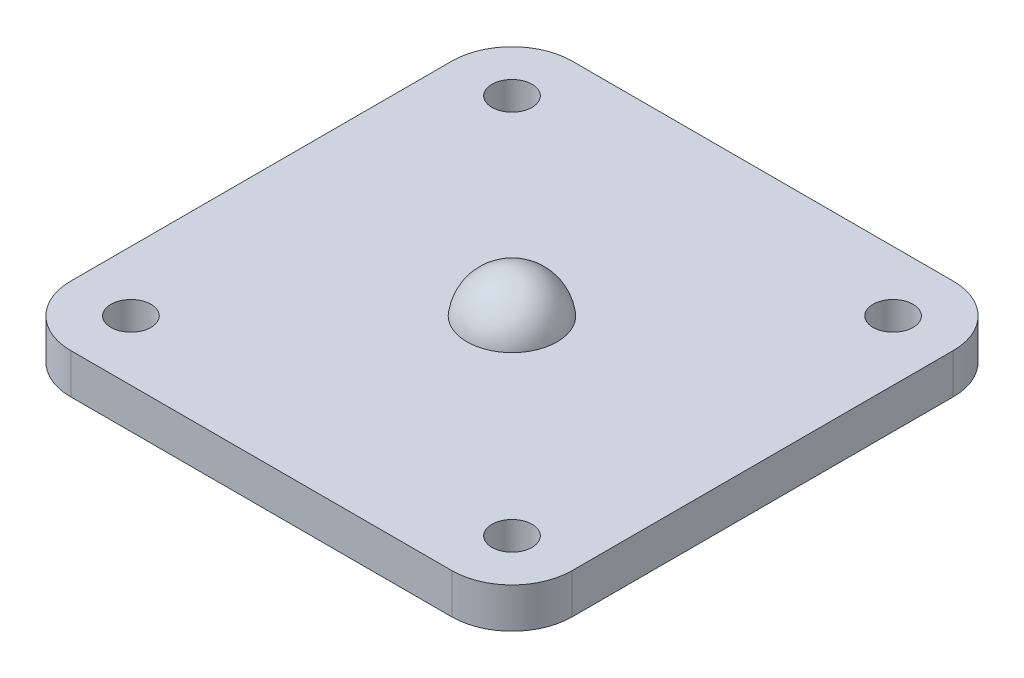
ISO-10303-21;
HEADER;
FILE_DESCRIPTION(('STEP AP214'),'2;1');
FILE_NAME('part.step','',(''),(''),'','','');
FILE_SCHEMA(('AUTOMOTIVE_DESIGN { 1 0 10303 214 1 1 1 1 }'));
ENDSEC;
DATA;
#1=APPLICATION_CONTEXT('core data for automotive mechanical design processes');
#2=APPLICATION_PROTOCOL_DEFINITION('international standard','automotive_design',2000,#1);
#3=PRODUCT_CONTEXT('',#1,'mechanical');
#4=PRODUCT('Part','Part','',(#3));
#5=PRODUCT_RELATED_PRODUCT_CATEGORY('part','',(#4));
#6=PRODUCT_DEFINITION_FORMATION('','',#4);
#7=PRODUCT_DEFINITION_CONTEXT('part definition',#1,'design');
#8=PRODUCT_DEFINITION('design','',#6,#7);
#9=PRODUCT_DEFINITION_SHAPE('','',#8);
#10=(LENGTH_UNIT() NAMED_UNIT(*) SI_UNIT(.MILLI.,.METRE.));
#11=(NAMED_UNIT(*) PLANE_ANGLE_UNIT() SI_UNIT($,.RADIAN.));
#12=(NAMED_UNIT(*) SI_UNIT($,.STERADIAN.) SOLID_ANGLE_UNIT());
#13=UNCERTAINTY_MEASURE_WITH_UNIT(LENGTH_MEASURE(1.E-05),#10,'distance_accuracy_value','');
#14=(GEOMETRIC_REPRESENTATION_CONTEXT(3) GLOBAL_UNCERTAINTY_ASSIGNED_CONTEXT((#13)) GLOBAL_UNIT_ASSIGNED_CONTEXT((#10,
#11,#12)) REPRESENTATION_CONTEXT('',''));
#15=CARTESIAN_POINT('',(0.,0.,0.));
#16=DIRECTION('',(0.,0.,1.));
#17=DIRECTION('',(1.,0.,0.));
#18=AXIS2_PLACEMENT_3D('',#15,#16,#17);
#19=CARTESIAN_POINT('',(12.5,2.,12.5));
#20=DIRECTION('',(-1.,0.,0.));
#21=DIRECTION('',(0.,0.,1.));
#22=AXIS2_PLACEMENT_3D('',#19,#20,#21);
#23=PLANE('',#22);
#24=DIRECTION('',(0.,0.,-1.));
#25=VECTOR('',#24,1.);
#26=CARTESIAN_POINT('',(12.5,0.,12.5));
#27=LINE('',#26,#25);
#28=CARTESIAN_POINT('',(12.5,0.,9.5));
#29=VERTEX_POINT('',#28);
#30=CARTESIAN_POINT('',(12.5,0.,-9.5));
#31=VERTEX_POINT('',#30);
#32=EDGE_CURVE('E142',#29,#31,#27,.T.);
#33=ORIENTED_EDGE('',*,*,#32,.T.);
#34=DIRECTION('',(0.,-1.,0.));
#35=VECTOR('',#34,1.);
#36=CARTESIAN_POINT('',(12.5,2.,-9.5));
#37=LINE('',#36,#35);
#38=CARTESIAN_POINT('',(12.5,2.,-9.5));
#39=VERTEX_POINT('',#38);
#40=EDGE_CURVE('E175',#31,#39,#37,.F.);
#41=ORIENTED_EDGE('',*,*,#40,.T.);
#42=DIRECTION('',(0.,0.,-1.));
#43=VECTOR('',#42,1.);
#44=CARTESIAN_POINT('',(12.5,2.,12.5));
#45=LINE('',#44,#43);
#46=CARTESIAN_POINT('',(12.5,2.,9.5));
#47=VERTEX_POINT('',#46);
#48=EDGE_CURVE('E140',#47,#39,#45,.T.);
#49=ORIENTED_EDGE('',*,*,#48,.F.);
#50=DIRECTION('',(0.,-1.,0.));
#51=VECTOR('',#50,1.);
#52=CARTESIAN_POINT('',(12.5,2.,9.5));
#53=LINE('',#52,#51);
#54=EDGE_CURVE('E171',#47,#29,#53,.T.);
#55=ORIENTED_EDGE('',*,*,#54,.T.);
#56=EDGE_LOOP('',(#33,#41,#49,#55));
#57=FACE_BOUND('',#56,.T.);
#58=ADVANCED_FACE('F39',(#57),#23,.F.);
#59=CARTESIAN_POINT('',(-12.5,2.,-12.5));
#60=DIRECTION('',(0.,0.,1.));
#61=DIRECTION('',(1.,0.,0.));
#62=AXIS2_PLACEMENT_3D('',#59,#60,#61);
#63=PLANE('',#62);
#64=DIRECTION('',(-1.,0.,0.));
#65=VECTOR('',#64,1.);
#66=CARTESIAN_POINT('',(-12.5,0.,-12.5));
#67=LINE('',#66,#65);
#68=CARTESIAN_POINT('',(9.5,0.,-12.5));
#69=VERTEX_POINT('',#68);
#70=CARTESIAN_POINT('',(-9.5,0.,-12.5));
#71=VERTEX_POINT('',#70);
#72=EDGE_CURVE('E136',#69,#71,#67,.T.);
#73=ORIENTED_EDGE('',*,*,#72,.T.);
#74=DIRECTION('',(0.,-1.,0.));
#75=VECTOR('',#74,1.);
#76=CARTESIAN_POINT('',(-9.5,2.,-12.5));
#77=LINE('',#76,#75);
#78=CARTESIAN_POINT('',(-9.5,2.,-12.5));
#79=VERTEX_POINT('',#78);
#80=EDGE_CURVE('E111',#71,#79,#77,.F.);
#81=ORIENTED_EDGE('',*,*,#80,.T.);
#82=DIRECTION('',(-1.,0.,0.));
#83=VECTOR('',#82,1.);
#84=CARTESIAN_POINT('',(-12.5,2.,-12.5));
#85=LINE('',#84,#83);
#86=CARTESIAN_POINT('',(9.5,2.,-12.5));
#87=VERTEX_POINT('',#86);
#88=EDGE_CURVE('E182',#87,#79,#85,.T.);
#89=ORIENTED_EDGE('',*,*,#88,.F.);
#90=DIRECTION('',(0.,-1.,0.));
#91=VECTOR('',#90,1.);
#92=CARTESIAN_POINT('',(9.5,2.,-12.5));
#93=LINE('',#92,#91);
#94=EDGE_CURVE('E117',#87,#69,#93,.T.);
#95=ORIENTED_EDGE('',*,*,#94,.T.);
#96=EDGE_LOOP('',(#73,#81,#89,#95));
#97=FACE_BOUND('',#96,.T.);
#98=ADVANCED_FACE('F251',(#97),#63,.F.);
#99=CARTESIAN_POINT('',(-12.5,2.,12.5));
#100=DIRECTION('',(1.,0.,0.));
#101=DIRECTION('',(0.,0.,-1.));
#102=AXIS2_PLACEMENT_3D('',#99,#100,#101);
#103=PLANE('',#102);
#104=DIRECTION('',(0.,0.,1.));
#105=VECTOR('',#104,1.);
#106=CARTESIAN_POINT('',(-12.5,2.,12.5));
#107=LINE('',#106,#105);
#108=CARTESIAN_POINT('',(-12.5,2.,-9.5));
#109=VERTEX_POINT('',#108);
#110=CARTESIAN_POINT('',(-12.5,2.,9.5));
#111=VERTEX_POINT('',#110);
#112=EDGE_CURVE('E126',#109,#111,#107,.T.);
#113=ORIENTED_EDGE('',*,*,#112,.F.);
#114=DIRECTION('',(0.,-1.,0.));
#115=VECTOR('',#114,1.);
#116=CARTESIAN_POINT('',(-12.5,2.,-9.5));
#117=LINE('',#116,#115);
#118=CARTESIAN_POINT('',(-12.5,0.,-9.5));
#119=VERTEX_POINT('',#118);
#120=EDGE_CURVE('E110',#109,#119,#117,.T.);
#121=ORIENTED_EDGE('',*,*,#120,.T.);
#122=DIRECTION('',(0.,0.,1.));
#123=VECTOR('',#122,1.);
#124=CARTESIAN_POINT('',(-12.5,0.,12.5));
#125=LINE('',#124,#123);
#126=CARTESIAN_POINT('',(-12.5,0.,9.5));
#127=VERTEX_POINT('',#126);
#128=EDGE_CURVE('E124',#119,#127,#125,.T.);
#129=ORIENTED_EDGE('',*,*,#128,.T.);
#130=DIRECTION('',(0.,-1.,0.));
#131=VECTOR('',#130,1.);
#132=CARTESIAN_POINT('',(-12.5,2.,9.5));
#133=LINE('',#132,#131);
#134=EDGE_CURVE('E129',#127,#111,#133,.F.);
#135=ORIENTED_EDGE('',*,*,#134,.T.);
#136=EDGE_LOOP('',(#113,#121,#129,#135));
#137=FACE_BOUND('',#136,.T.);
#138=ADVANCED_FACE('F123',(#137),#103,.F.);
#139=CARTESIAN_POINT('',(-12.5,2.,12.5));
#140=DIRECTION('',(0.,0.,-1.));
#141=DIRECTION('',(-1.,0.,0.));
#142=AXIS2_PLACEMENT_3D('',#139,#140,#141);
#143=PLANE('',#142);
#144=DIRECTION('',(1.,0.,0.));
#145=VECTOR('',#144,1.);
#146=CARTESIAN_POINT('',(-12.5,2.,12.5));
#147=LINE('',#146,#145);
#148=CARTESIAN_POINT('',(-9.5,2.,12.5));
#149=VERTEX_POINT('',#148);
#150=CARTESIAN_POINT('',(9.5,2.,12.5));
#151=VERTEX_POINT('',#150);
#152=EDGE_CURVE('E147',#149,#151,#147,.T.);
#153=ORIENTED_EDGE('',*,*,#152,.F.);
#154=DIRECTION('',(0.,-1.,0.));
#155=VECTOR('',#154,1.);
#156=CARTESIAN_POINT('',(-9.5,2.,12.5));
#157=LINE('',#156,#155);
#158=CARTESIAN_POINT('',(-9.5,0.,12.5));
#159=VERTEX_POINT('',#158);
#160=EDGE_CURVE('E11',#149,#159,#157,.T.);
#161=ORIENTED_EDGE('',*,*,#160,.T.);
#162=DIRECTION('',(1.,0.,0.));
#163=VECTOR('',#162,1.);
#164=CARTESIAN_POINT('',(-12.5,0.,12.5));
#165=LINE('',#164,#163);
#166=CARTESIAN_POINT('',(9.5,0.,12.5));
#167=VERTEX_POINT('',#166);
#168=EDGE_CURVE('E135',#159,#167,#165,.T.);
#169=ORIENTED_EDGE('',*,*,#168,.T.);
#170=DIRECTION('',(0.,-1.,0.));
#171=VECTOR('',#170,1.);
#172=CARTESIAN_POINT('',(9.5,2.,12.5));
#173=LINE('',#172,#171);
#174=EDGE_CURVE('E48',#167,#151,#173,.F.);
#175=ORIENTED_EDGE('',*,*,#174,.T.);
#176=EDGE_LOOP('',(#153,#161,#169,#175));
#177=FACE_BOUND('',#176,.T.);
#178=ADVANCED_FACE('F274',(#177),#143,.F.);
#179=CARTESIAN_POINT('',(0.,2.,0.));
#180=DIRECTION('',(0.,-1.,0.));
#181=DIRECTION('',(0.,0.,-1.));
#182=AXIS2_PLACEMENT_3D('',#179,#180,#181);
#183=PLANE('',#182);
#184=CARTESIAN_POINT('',(0.,2.,0.));
#185=DIRECTION('',(0.,-1.,0.));
#186=DIRECTION('',(0.,0.,-1.));
#187=AXIS2_PLACEMENT_3D('',#184,#185,#186);
#188=CIRCLE('',#187,2.25);
#189=CARTESIAN_POINT('',(0.,2.,-2.25));
#190=VERTEX_POINT('',#189);
#191=EDGE_CURVE('E213',#190,#190,#188,.T.);
#192=ORIENTED_EDGE('',*,*,#191,.T.);
#193=EDGE_LOOP('',(#192));
#194=FACE_BOUND('',#193,.T.);
#195=CARTESIAN_POINT('',(-9.5,2.,9.5));
#196=DIRECTION('',(0.,1.,0.));
#197=DIRECTION('',(0.,0.,1.));
#198=AXIS2_PLACEMENT_3D('',#195,#196,#197);
#199=CIRCLE('',#198,1.);
#200=CARTESIAN_POINT('',(-9.5,2.,10.5));
#201=VERTEX_POINT('',#200);
#202=EDGE_CURVE('E212',#201,#201,#199,.T.);
#203=ORIENTED_EDGE('',*,*,#202,.F.);
#204=EDGE_LOOP('',(#203));
#205=FACE_BOUND('',#204,.T.);
#206=CARTESIAN_POINT('',(9.5,2.,9.5));
#207=DIRECTION('',(0.,1.,0.));
#208=DIRECTION('',(0.,0.,1.));
#209=AXIS2_PLACEMENT_3D('',#206,#207,#208);
#210=CIRCLE('',#209,1.);
#211=CARTESIAN_POINT('',(9.5,2.,10.5));
#212=VERTEX_POINT('',#211);
#213=EDGE_CURVE('E221',#212,#212,#210,.T.);
#214=ORIENTED_EDGE('',*,*,#213,.F.);
#215=EDGE_LOOP('',(#214));
#216=FACE_BOUND('',#215,.T.);
#217=CARTESIAN_POINT('',(9.5,2.,-9.5));
#218=DIRECTION('',(0.,1.,0.));
#219=DIRECTION('',(0.,0.,1.));
#220=AXIS2_PLACEMENT_3D('',#217,#218,#219);
#221=CIRCLE('',#220,1.);
#222=CARTESIAN_POINT('',(9.5,2.,-8.5));
#223=VERTEX_POINT('',#222);
#224=EDGE_CURVE('E206',#223,#223,#221,.T.);
#225=ORIENTED_EDGE('',*,*,#224,.F.);
#226=EDGE_LOOP('',(#225));
#227=FACE_BOUND('',#226,.T.);
#228=CARTESIAN_POINT('',(-9.5,2.,-9.5));
#229=DIRECTION('',(0.,1.,0.));
#230=DIRECTION('',(0.,0.,1.));
#231=AXIS2_PLACEMENT_3D('',#228,#229,#230);
#232=CIRCLE('',#231,1.);
#233=CARTESIAN_POINT('',(-9.5,2.,-8.5));
#234=VERTEX_POINT('',#233);
#235=EDGE_CURVE('E196',#234,#234,#232,.T.);
#236=ORIENTED_EDGE('',*,*,#235,.F.);
#237=EDGE_LOOP('',(#236));
#238=FACE_BOUND('',#237,.T.);
#239=ORIENTED_EDGE('',*,*,#88,.T.);
#240=CARTESIAN_POINT('',(-9.5,2.,-9.5));
#241=DIRECTION('',(0.,-1.,0.));
#242=DIRECTION('',(0.,0.,-1.));
#243=AXIS2_PLACEMENT_3D('',#240,#241,#242);
#244=CIRCLE('',#243,3.);
#245=EDGE_CURVE('E168',#79,#109,#244,.F.);
#246=ORIENTED_EDGE('',*,*,#245,.T.);
#247=ORIENTED_EDGE('',*,*,#112,.T.);
#248=CARTESIAN_POINT('',(-9.5,2.,9.5));
#249=DIRECTION('',(0.,-1.,0.));
#250=DIRECTION('',(0.,0.,-1.));
#251=AXIS2_PLACEMENT_3D('',#248,#249,#250);
#252=CIRCLE('',#251,3.);
#253=EDGE_CURVE('E61',#111,#149,#252,.F.);
#254=ORIENTED_EDGE('',*,*,#253,.T.);
#255=ORIENTED_EDGE('',*,*,#152,.T.);
#256=CARTESIAN_POINT('',(9.5,2.,9.5));
#257=DIRECTION('',(0.,-1.,0.));
#258=DIRECTION('',(0.,0.,-1.));
#259=AXIS2_PLACEMENT_3D('',#256,#257,#258);
#260=CIRCLE('',#259,3.);
#261=EDGE_CURVE('E160',#151,#47,#260,.F.);
#262=ORIENTED_EDGE('',*,*,#261,.T.);
#263=ORIENTED_EDGE('',*,*,#48,.T.);
#264=CARTESIAN_POINT('',(9.5,2.,-9.5));
#265=DIRECTION('',(0.,-1.,0.));
#266=DIRECTION('',(0.,0.,-1.));
#267=AXIS2_PLACEMENT_3D('',#264,#265,#266);
#268=CIRCLE('',#267,3.);
#269=EDGE_CURVE('E165',#39,#87,#268,.F.);
#270=ORIENTED_EDGE('',*,*,#269,.T.);
#271=EDGE_LOOP('',(#239,#246,#247,#254,#255,#262,#263,#270));
#272=FACE_BOUND('',#271,.T.);
#273=ADVANCED_FACE('F236',(#194,#205,#216,#227,#238,#272),#183,.F.);
#274=CARTESIAN_POINT('',(0.,0.,0.));
#275=DIRECTION('',(0.,-1.,0.));
#276=DIRECTION('',(0.,0.,-1.));
#277=AXIS2_PLACEMENT_3D('',#274,#275,#276);
#278=PLANE('',#277);
#279=CARTESIAN_POINT('',(-9.5,0.,9.5));
#280=DIRECTION('',(0.,-1.,0.));
#281=DIRECTION('',(0.,0.,-1.));
#282=AXIS2_PLACEMENT_3D('',#279,#280,#281);
#283=CIRCLE('',#282,1.);
#284=CARTESIAN_POINT('',(-9.5,0.,8.5));
#285=VERTEX_POINT('',#284);
#286=EDGE_CURVE('E208',#285,#285,#283,.F.);
#287=ORIENTED_EDGE('',*,*,#286,.T.);
#288=EDGE_LOOP('',(#287));
#289=FACE_BOUND('',#288,.T.);
#290=CARTESIAN_POINT('',(9.5,0.,9.5));
#291=DIRECTION('',(0.,-1.,0.));
#292=DIRECTION('',(0.,0.,-1.));
#293=AXIS2_PLACEMENT_3D('',#290,#291,#292);
#294=CIRCLE('',#293,1.);
#295=CARTESIAN_POINT('',(9.5,0.,8.5));
#296=VERTEX_POINT('',#295);
#297=EDGE_CURVE('E217',#296,#296,#294,.F.);
#298=ORIENTED_EDGE('',*,*,#297,.T.);
#299=EDGE_LOOP('',(#298));
#300=FACE_BOUND('',#299,.T.);
#301=CARTESIAN_POINT('',(9.5,0.,-9.5));
#302=DIRECTION('',(0.,-1.,0.));
#303=DIRECTION('',(0.,0.,-1.));
#304=AXIS2_PLACEMENT_3D('',#301,#302,#303);
#305=CIRCLE('',#304,1.);
#306=CARTESIAN_POINT('',(9.5,0.,-10.5));
#307=VERTEX_POINT('',#306);
#308=EDGE_CURVE('E225',#307,#307,#305,.F.);
#309=ORIENTED_EDGE('',*,*,#308,.T.);
#310=EDGE_LOOP('',(#309));
#311=FACE_BOUND('',#310,.T.);
#312=CARTESIAN_POINT('',(-9.5,0.,-9.5));
#313=DIRECTION('',(0.,-1.,0.));
#314=DIRECTION('',(0.,0.,-1.));
#315=AXIS2_PLACEMENT_3D('',#312,#313,#314);
#316=CIRCLE('',#315,1.);
#317=CARTESIAN_POINT('',(-9.5,0.,-10.5));
#318=VERTEX_POINT('',#317);
#319=EDGE_CURVE('E192',#318,#318,#316,.F.);
#320=ORIENTED_EDGE('',*,*,#319,.T.);
#321=EDGE_LOOP('',(#320));
#322=FACE_BOUND('',#321,.T.);
#323=ORIENTED_EDGE('',*,*,#128,.F.);
#324=CARTESIAN_POINT('',(-9.5,0.,-9.5));
#325=DIRECTION('',(0.,-1.,0.));
#326=DIRECTION('',(0.,0.,-1.));
#327=AXIS2_PLACEMENT_3D('',#324,#325,#326);
#328=CIRCLE('',#327,3.);
#329=EDGE_CURVE('E106',#119,#71,#328,.T.);
#330=ORIENTED_EDGE('',*,*,#329,.T.);
#331=ORIENTED_EDGE('',*,*,#72,.F.);
#332=CARTESIAN_POINT('',(9.5,0.,-9.5));
#333=DIRECTION('',(0.,-1.,0.));
#334=DIRECTION('',(0.,0.,-1.));
#335=AXIS2_PLACEMENT_3D('',#332,#333,#334);
#336=CIRCLE('',#335,3.);
#337=EDGE_CURVE('E118',#69,#31,#336,.T.);
#338=ORIENTED_EDGE('',*,*,#337,.T.);
#339=ORIENTED_EDGE('',*,*,#32,.F.);
#340=CARTESIAN_POINT('',(9.5,0.,9.5));
#341=DIRECTION('',(0.,-1.,0.));
#342=DIRECTION('',(0.,0.,-1.));
#343=AXIS2_PLACEMENT_3D('',#340,#341,#342);
#344=CIRCLE('',#343,3.);
#345=EDGE_CURVE('E128',#29,#167,#344,.T.);
#346=ORIENTED_EDGE('',*,*,#345,.T.);
#347=ORIENTED_EDGE('',*,*,#168,.F.);
#348=CARTESIAN_POINT('',(-9.5,0.,9.5));
#349=DIRECTION('',(0.,-1.,0.));
#350=DIRECTION('',(0.,0.,-1.));
#351=AXIS2_PLACEMENT_3D('',#348,#349,#350);
#352=CIRCLE('',#351,3.);
#353=EDGE_CURVE('E133',#159,#127,#352,.T.);
#354=ORIENTED_EDGE('',*,*,#353,.T.);
#355=EDGE_LOOP('',(#323,#330,#331,#338,#339,#346,#347,#354));
#356=FACE_BOUND('',#355,.T.);
#357=ADVANCED_FACE('F131',(#289,#300,#311,#322,#356),#278,.T.);
#358=CARTESIAN_POINT('',(-9.5,2.,-9.5));
#359=DIRECTION('',(0.,-1.,0.));
#360=DIRECTION('',(0.,0.,-1.));
#361=AXIS2_PLACEMENT_3D('',#358,#359,#360);
#362=CYLINDRICAL_SURFACE('',#361,3.);
#363=ORIENTED_EDGE('',*,*,#245,.F.);
#364=ORIENTED_EDGE('',*,*,#80,.F.);
#365=ORIENTED_EDGE('',*,*,#329,.F.);
#366=ORIENTED_EDGE('',*,*,#120,.F.);
#367=EDGE_LOOP('',(#363,#364,#365,#366));
#368=FACE_BOUND('',#367,.T.);
#369=ADVANCED_FACE('F109',(#368),#362,.T.);
#370=CARTESIAN_POINT('',(9.5,2.,-9.5));
#371=DIRECTION('',(0.,-1.,0.));
#372=DIRECTION('',(0.,0.,-1.));
#373=AXIS2_PLACEMENT_3D('',#370,#371,#372);
#374=CYLINDRICAL_SURFACE('',#373,3.);
#375=ORIENTED_EDGE('',*,*,#269,.F.);
#376=ORIENTED_EDGE('',*,*,#40,.F.);
#377=ORIENTED_EDGE('',*,*,#337,.F.);
#378=ORIENTED_EDGE('',*,*,#94,.F.);
#379=EDGE_LOOP('',(#375,#376,#377,#378));
#380=FACE_BOUND('',#379,.T.);
#381=ADVANCED_FACE('F262',(#380),#374,.T.);
#382=CARTESIAN_POINT('',(-9.5,2.,9.5));
#383=DIRECTION('',(0.,-1.,0.));
#384=DIRECTION('',(0.,0.,-1.));
#385=AXIS2_PLACEMENT_3D('',#382,#383,#384);
#386=CYLINDRICAL_SURFACE('',#385,3.);
#387=ORIENTED_EDGE('',*,*,#253,.F.);
#388=ORIENTED_EDGE('',*,*,#134,.F.);
#389=ORIENTED_EDGE('',*,*,#353,.F.);
#390=ORIENTED_EDGE('',*,*,#160,.F.);
#391=EDGE_LOOP('',(#387,#388,#389,#390));
#392=FACE_BOUND('',#391,.T.);
#393=ADVANCED_FACE('F264',(#392),#386,.T.);
#394=CARTESIAN_POINT('',(9.5,2.,9.5));
#395=DIRECTION('',(0.,-1.,0.));
#396=DIRECTION('',(0.,0.,-1.));
#397=AXIS2_PLACEMENT_3D('',#394,#395,#396);
#398=CYLINDRICAL_SURFACE('',#397,3.);
#399=ORIENTED_EDGE('',*,*,#261,.F.);
#400=ORIENTED_EDGE('',*,*,#174,.F.);
#401=ORIENTED_EDGE('',*,*,#345,.F.);
#402=ORIENTED_EDGE('',*,*,#54,.F.);
#403=EDGE_LOOP('',(#399,#400,#401,#402));
#404=FACE_BOUND('',#403,.T.);
#405=ADVANCED_FACE('F41',(#404),#398,.T.);
#406=CARTESIAN_POINT('',(-9.5,-0.00100000000000013,-9.5));
#407=DIRECTION('',(0.,1.,0.));
#408=DIRECTION('',(0.,0.,1.));
#409=AXIS2_PLACEMENT_3D('',#406,#407,#408);
#410=CYLINDRICAL_SURFACE('',#409,1.);
#411=ORIENTED_EDGE('',*,*,#319,.F.);
#412=EDGE_LOOP('',(#411));
#413=FACE_BOUND('',#412,.T.);
#414=ORIENTED_EDGE('',*,*,#235,.T.);
#415=EDGE_LOOP('',(#414));
#416=FACE_BOUND('',#415,.T.);
#417=ADVANCED_FACE('F271',(#413,#416),#410,.F.);
#418=CARTESIAN_POINT('',(9.5,-0.00100000000000013,-9.5));
#419=DIRECTION('',(0.,1.,0.));
#420=DIRECTION('',(0.,0.,1.));
#421=AXIS2_PLACEMENT_3D('',#418,#419,#420);
#422=CYLINDRICAL_SURFACE('',#421,1.);
#423=ORIENTED_EDGE('',*,*,#308,.F.);
#424=EDGE_LOOP('',(#423));
#425=FACE_BOUND('',#424,.T.);
#426=ORIENTED_EDGE('',*,*,#224,.T.);
#427=EDGE_LOOP('',(#426));
#428=FACE_BOUND('',#427,.T.);
#429=ADVANCED_FACE('F336',(#425,#428),#422,.F.);
#430=CARTESIAN_POINT('',(9.5,-0.00100000000000013,9.5));
#431=DIRECTION('',(0.,1.,0.));
#432=DIRECTION('',(0.,0.,1.));
#433=AXIS2_PLACEMENT_3D('',#430,#431,#432);
#434=CYLINDRICAL_SURFACE('',#433,1.);
#435=ORIENTED_EDGE('',*,*,#297,.F.);
#436=EDGE_LOOP('',(#435));
#437=FACE_BOUND('',#436,.T.);
#438=ORIENTED_EDGE('',*,*,#213,.T.);
#439=EDGE_LOOP('',(#438));
#440=FACE_BOUND('',#439,.T.);
#441=ADVANCED_FACE('F246',(#437,#440),#434,.F.);
#442=CARTESIAN_POINT('',(-9.5,-0.00100000000000013,9.5));
#443=DIRECTION('',(0.,1.,0.));
#444=DIRECTION('',(0.,0.,1.));
#445=AXIS2_PLACEMENT_3D('',#442,#443,#444);
#446=CYLINDRICAL_SURFACE('',#445,1.);
#447=ORIENTED_EDGE('',*,*,#286,.F.);
#448=EDGE_LOOP('',(#447));
#449=FACE_BOUND('',#448,.T.);
#450=ORIENTED_EDGE('',*,*,#202,.T.);
#451=EDGE_LOOP('',(#450));
#452=FACE_BOUND('',#451,.T.);
#453=ADVANCED_FACE('F241',(#449,#452),#446,.F.);
#454=CARTESIAN_POINT('',(0.,1.734375,0.));
#455=DIRECTION('',(0.,-1.,0.));
#456=DIRECTION('',(1.,0.,0.));
#457=AXIS2_PLACEMENT_3D('',#454,#455,#456);
#458=SPHERICAL_SURFACE('',#457,2.265625);
#459=ORIENTED_EDGE('',*,*,#191,.F.);
#460=EDGE_LOOP('',(#459));
#461=FACE_BOUND('',#460,.T.);
#462=ADVANCED_FACE('F239',(#461),#458,.T.);
#463=CLOSED_SHELL('',(#58,#98,#138,#178,#273,#357,#369,#381,#393,#405,#417,#429,#441,#453,#462));
#464=MANIFOLD_SOLID_BREP('B2',#463);
#465=ADVANCED_BREP_SHAPE_REPRESENTATION('',(#18,#464),#14);
#466=SHAPE_DEFINITION_REPRESENTATION(#9,#465);
ENDSEC;
END-ISO-10303-21;
